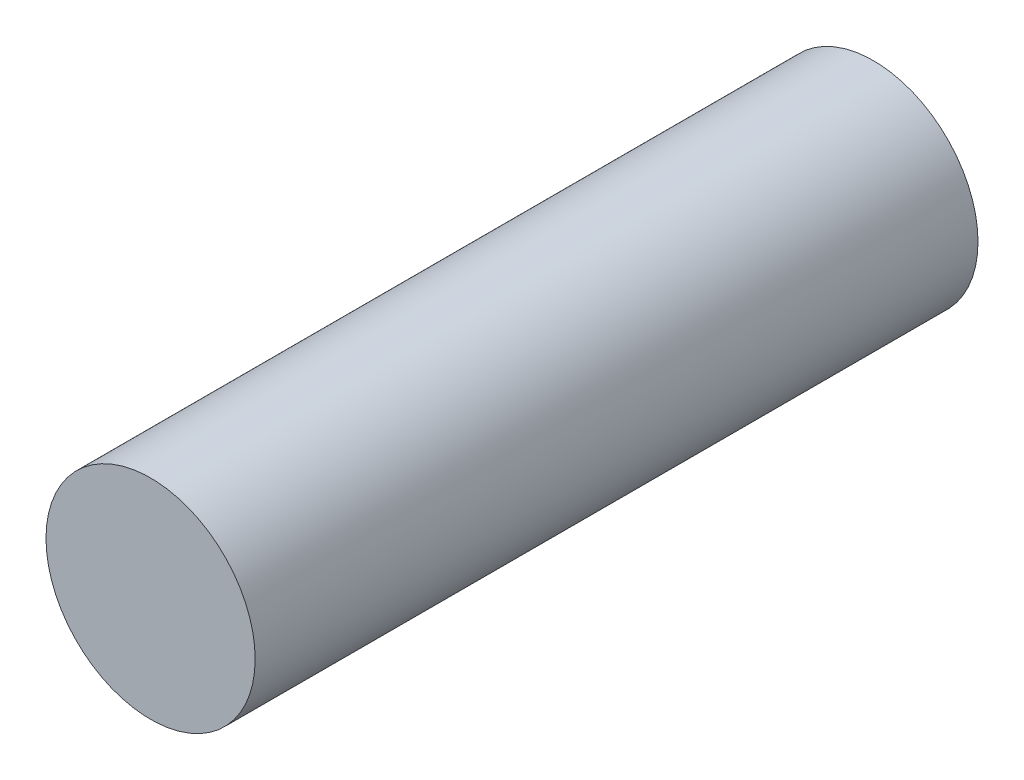
ISO-10303-21;
HEADER;
FILE_DESCRIPTION(('STEP AP214'),'2;1');
FILE_NAME('part.step','',(''),(''),'','','');
FILE_SCHEMA(('AUTOMOTIVE_DESIGN { 1 0 10303 214 1 1 1 1 }'));
ENDSEC;
DATA;
#1=APPLICATION_CONTEXT('core data for automotive mechanical design processes');
#2=APPLICATION_PROTOCOL_DEFINITION('international standard','automotive_design',2000,#1);
#3=PRODUCT_CONTEXT('',#1,'mechanical');
#4=PRODUCT('Part','Part','',(#3));
#5=PRODUCT_RELATED_PRODUCT_CATEGORY('part','',(#4));
#6=PRODUCT_DEFINITION_FORMATION('','',#4);
#7=PRODUCT_DEFINITION_CONTEXT('part definition',#1,'design');
#8=PRODUCT_DEFINITION('design','',#6,#7);
#9=PRODUCT_DEFINITION_SHAPE('','',#8);
#10=(LENGTH_UNIT() NAMED_UNIT(*) SI_UNIT(.MILLI.,.METRE.));
#11=(NAMED_UNIT(*) PLANE_ANGLE_UNIT() SI_UNIT($,.RADIAN.));
#12=(NAMED_UNIT(*) SI_UNIT($,.STERADIAN.) SOLID_ANGLE_UNIT());
#13=UNCERTAINTY_MEASURE_WITH_UNIT(LENGTH_MEASURE(1.E-05),#10,'distance_accuracy_value','');
#14=(GEOMETRIC_REPRESENTATION_CONTEXT(3) GLOBAL_UNCERTAINTY_ASSIGNED_CONTEXT((#13)) GLOBAL_UNIT_ASSIGNED_CONTEXT((#10,
#11,#12)) REPRESENTATION_CONTEXT('',''));
#15=CARTESIAN_POINT('',(0.,0.,0.));
#16=DIRECTION('',(0.,0.,1.));
#17=DIRECTION('',(1.,0.,0.));
#18=AXIS2_PLACEMENT_3D('',#15,#16,#17);
#19=CARTESIAN_POINT('',(0.,0.,50.8));
#20=DIRECTION('',(0.,0.,-1.));
#21=DIRECTION('',(-1.,0.,0.));
#22=AXIS2_PLACEMENT_3D('',#19,#20,#21);
#23=CYLINDRICAL_SURFACE('',#22,7.35);
#24=CARTESIAN_POINT('',(0.,0.,50.8));
#25=DIRECTION('',(0.,0.,1.));
#26=DIRECTION('',(1.,0.,0.));
#27=AXIS2_PLACEMENT_3D('',#24,#25,#26);
#28=CIRCLE('',#27,7.35);
#29=CARTESIAN_POINT('',(7.35,0.,50.8));
#30=VERTEX_POINT('',#29);
#31=EDGE_CURVE('E10',#30,#30,#28,.T.);
#32=ORIENTED_EDGE('',*,*,#31,.F.);
#33=EDGE_LOOP('',(#32));
#34=FACE_BOUND('',#33,.T.);
#35=CARTESIAN_POINT('',(0.,0.,0.));
#36=DIRECTION('',(0.,0.,1.));
#37=DIRECTION('',(1.,0.,0.));
#38=AXIS2_PLACEMENT_3D('',#35,#36,#37);
#39=CIRCLE('',#38,7.35);
#40=CARTESIAN_POINT('',(7.35,0.,0.));
#41=VERTEX_POINT('',#40);
#42=EDGE_CURVE('E35',#41,#41,#39,.T.);
#43=ORIENTED_EDGE('',*,*,#42,.T.);
#44=EDGE_LOOP('',(#43));
#45=FACE_BOUND('',#44,.T.);
#46=ADVANCED_FACE('F32',(#34,#45),#23,.T.);
#47=CARTESIAN_POINT('',(0.,0.,50.8));
#48=DIRECTION('',(0.,0.,1.));
#49=DIRECTION('',(1.,0.,0.));
#50=AXIS2_PLACEMENT_3D('',#47,#48,#49);
#51=PLANE('',#50);
#52=ORIENTED_EDGE('',*,*,#31,.T.);
#53=EDGE_LOOP('',(#52));
#54=FACE_BOUND('',#53,.T.);
#55=ADVANCED_FACE('F61',(#54),#51,.T.);
#56=CARTESIAN_POINT('',(0.,0.,0.));
#57=DIRECTION('',(0.,0.,1.));
#58=DIRECTION('',(1.,0.,0.));
#59=AXIS2_PLACEMENT_3D('',#56,#57,#58);
#60=PLANE('',#59);
#61=CARTESIAN_POINT('',(0.,0.,0.));
#62=DIRECTION('',(0.,0.,-1.));
#63=DIRECTION('',(-1.,0.,0.));
#64=AXIS2_PLACEMENT_3D('',#61,#62,#63);
#65=CIRCLE('',#64,1.985);
#66=CARTESIAN_POINT('',(-1.985,0.,0.));
#67=VERTEX_POINT('',#66);
#68=EDGE_CURVE('E44',#67,#67,#65,.T.);
#69=ORIENTED_EDGE('',*,*,#68,.F.);
#70=EDGE_LOOP('',(#69));
#71=FACE_BOUND('',#70,.T.);
#72=ORIENTED_EDGE('',*,*,#42,.F.);
#73=EDGE_LOOP('',(#72));
#74=FACE_BOUND('',#73,.T.);
#75=ADVANCED_FACE('F55',(#71,#74),#60,.F.);
#76=CARTESIAN_POINT('',(0.,0.,6.35));
#77=DIRECTION('',(0.,0.,-1.));
#78=DIRECTION('',(-1.,0.,0.));
#79=AXIS2_PLACEMENT_3D('',#76,#77,#78);
#80=CYLINDRICAL_SURFACE('',#79,1.985);
#81=CARTESIAN_POINT('',(0.,0.,6.35));
#82=DIRECTION('',(0.,0.,-1.));
#83=DIRECTION('',(-1.,0.,0.));
#84=AXIS2_PLACEMENT_3D('',#81,#82,#83);
#85=CIRCLE('',#84,1.985);
#86=CARTESIAN_POINT('',(-1.985,0.,6.35));
#87=VERTEX_POINT('',#86);
#88=EDGE_CURVE('E42',#87,#87,#85,.T.);
#89=ORIENTED_EDGE('',*,*,#88,.F.);
#90=EDGE_LOOP('',(#89));
#91=FACE_BOUND('',#90,.T.);
#92=ORIENTED_EDGE('',*,*,#68,.T.);
#93=EDGE_LOOP('',(#92));
#94=FACE_BOUND('',#93,.T.);
#95=ADVANCED_FACE('F52',(#91,#94),#80,.F.);
#96=CARTESIAN_POINT('',(0.,0.,6.35));
#97=DIRECTION('',(0.,0.,-1.));
#98=DIRECTION('',(-1.,0.,0.));
#99=AXIS2_PLACEMENT_3D('',#96,#97,#98);
#100=PLANE('',#99);
#101=ORIENTED_EDGE('',*,*,#88,.T.);
#102=EDGE_LOOP('',(#101));
#103=FACE_BOUND('',#102,.T.);
#104=ADVANCED_FACE('F50',(#103),#100,.T.);
#105=CLOSED_SHELL('',(#46,#55,#75,#95,#104));
#106=MANIFOLD_SOLID_BREP('B2',#105);
#107=ADVANCED_BREP_SHAPE_REPRESENTATION('',(#18,#106),#14);
#108=SHAPE_DEFINITION_REPRESENTATION(#9,#107);
ENDSEC;
END-ISO-10303-21;
